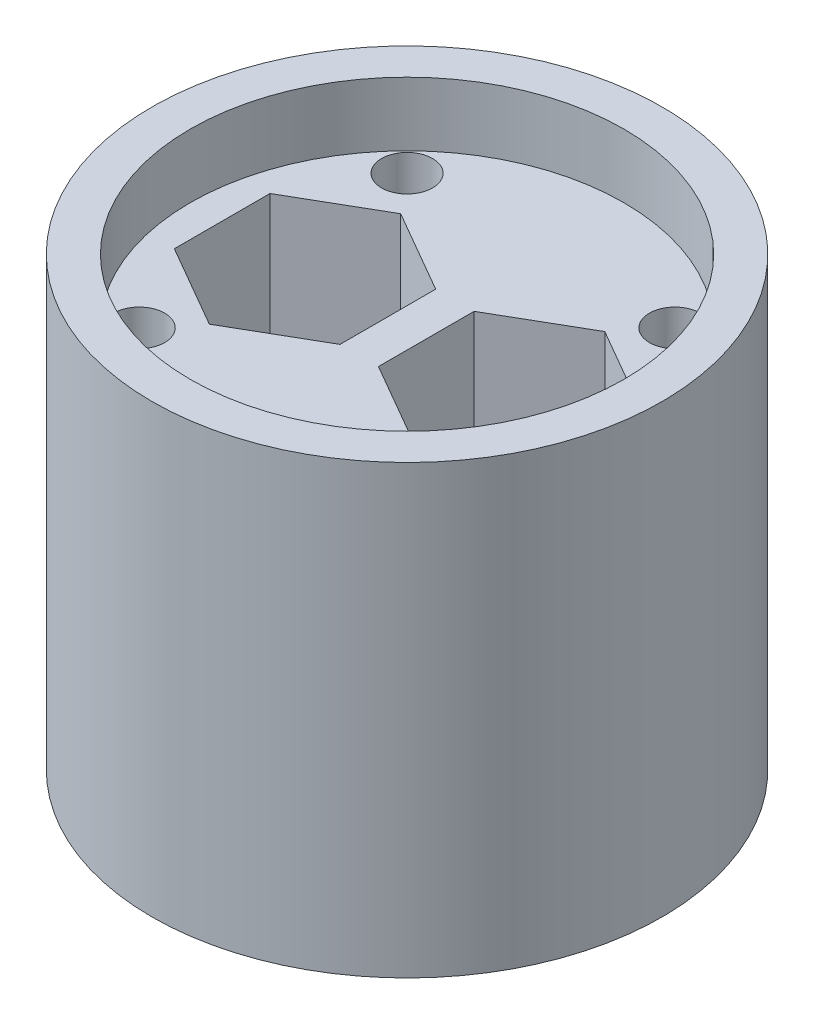
ISO-10303-21;
HEADER;
FILE_DESCRIPTION(('STEP AP214'),'2;1');
FILE_NAME('part.step','',(''),(''),'','','');
FILE_SCHEMA(('AUTOMOTIVE_DESIGN { 1 0 10303 214 1 1 1 1 }'));
ENDSEC;
DATA;
#1=APPLICATION_CONTEXT('core data for automotive mechanical design processes');
#2=APPLICATION_PROTOCOL_DEFINITION('international standard','automotive_design',2000,#1);
#3=PRODUCT_CONTEXT('',#1,'mechanical');
#4=PRODUCT('Part','Part','',(#3));
#5=PRODUCT_RELATED_PRODUCT_CATEGORY('part','',(#4));
#6=PRODUCT_DEFINITION_FORMATION('','',#4);
#7=PRODUCT_DEFINITION_CONTEXT('part definition',#1,'design');
#8=PRODUCT_DEFINITION('design','',#6,#7);
#9=PRODUCT_DEFINITION_SHAPE('','',#8);
#10=(LENGTH_UNIT() NAMED_UNIT(*) SI_UNIT(.MILLI.,.METRE.));
#11=(NAMED_UNIT(*) PLANE_ANGLE_UNIT() SI_UNIT($,.RADIAN.));
#12=(NAMED_UNIT(*) SI_UNIT($,.STERADIAN.) SOLID_ANGLE_UNIT());
#13=UNCERTAINTY_MEASURE_WITH_UNIT(LENGTH_MEASURE(1.E-05),#10,'distance_accuracy_value','');
#14=(GEOMETRIC_REPRESENTATION_CONTEXT(3) GLOBAL_UNCERTAINTY_ASSIGNED_CONTEXT((#13)) GLOBAL_UNIT_ASSIGNED_CONTEXT((#10,
#11,#12)) REPRESENTATION_CONTEXT('',''));
#15=CARTESIAN_POINT('',(0.,0.,0.));
#16=DIRECTION('',(0.,0.,1.));
#17=DIRECTION('',(1.,0.,0.));
#18=AXIS2_PLACEMENT_3D('',#15,#16,#17);
#19=CARTESIAN_POINT('',(-7.99999999999999,0.,0.));
#20=DIRECTION('',(0.,1.,0.));
#21=DIRECTION('',(0.,0.,1.));
#22=AXIS2_PLACEMENT_3D('',#19,#20,#21);
#23=CYLINDRICAL_SURFACE('',#22,4.1);
#24=CARTESIAN_POINT('',(-7.99999999999999,20.,0.));
#25=DIRECTION('',(0.,1.,0.));
#26=DIRECTION('',(0.,0.,1.));
#27=AXIS2_PLACEMENT_3D('',#24,#25,#26);
#28=CIRCLE('',#27,4.1);
#29=CARTESIAN_POINT('',(-7.99999999999999,20.,4.1));
#30=VERTEX_POINT('',#29);
#31=EDGE_CURVE('E251',#30,#30,#28,.T.);
#32=ORIENTED_EDGE('',*,*,#31,.T.);
#33=EDGE_LOOP('',(#32));
#34=FACE_BOUND('',#33,.T.);
#35=CARTESIAN_POINT('',(-7.99999999999999,2.,0.));
#36=DIRECTION('',(0.,-1.,0.));
#37=DIRECTION('',(0.,0.,-1.));
#38=AXIS2_PLACEMENT_3D('',#35,#36,#37);
#39=CIRCLE('',#38,4.1);
#40=CARTESIAN_POINT('',(-7.99999999999999,2.,-4.1));
#41=VERTEX_POINT('',#40);
#42=EDGE_CURVE('E194',#41,#41,#39,.F.);
#43=ORIENTED_EDGE('',*,*,#42,.F.);
#44=EDGE_LOOP('',(#43));
#45=FACE_BOUND('',#44,.T.);
#46=ADVANCED_FACE('F40',(#34,#45),#23,.F.);
#47=CARTESIAN_POINT('',(8.,0.,0.));
#48=DIRECTION('',(0.,1.,0.));
#49=DIRECTION('',(0.,0.,1.));
#50=AXIS2_PLACEMENT_3D('',#47,#48,#49);
#51=CYLINDRICAL_SURFACE('',#50,4.1);
#52=CARTESIAN_POINT('',(8.,20.,0.));
#53=DIRECTION('',(0.,1.,0.));
#54=DIRECTION('',(0.,0.,1.));
#55=AXIS2_PLACEMENT_3D('',#52,#53,#54);
#56=CIRCLE('',#55,4.1);
#57=CARTESIAN_POINT('',(8.,20.,4.1));
#58=VERTEX_POINT('',#57);
#59=EDGE_CURVE('E248',#58,#58,#56,.T.);
#60=ORIENTED_EDGE('',*,*,#59,.T.);
#61=EDGE_LOOP('',(#60));
#62=FACE_BOUND('',#61,.T.);
#63=CARTESIAN_POINT('',(8.,2.,0.));
#64=DIRECTION('',(0.,-1.,0.));
#65=DIRECTION('',(0.,0.,-1.));
#66=AXIS2_PLACEMENT_3D('',#63,#64,#65);
#67=CIRCLE('',#66,4.1);
#68=CARTESIAN_POINT('',(8.,2.,-4.1));
#69=VERTEX_POINT('',#68);
#70=EDGE_CURVE('E44',#69,#69,#67,.F.);
#71=ORIENTED_EDGE('',*,*,#70,.F.);
#72=EDGE_LOOP('',(#71));
#73=FACE_BOUND('',#72,.T.);
#74=ADVANCED_FACE('F352',(#62,#73),#51,.F.);
#75=CARTESIAN_POINT('',(-1.50480947161671,20.,-3.75));
#76=DIRECTION('',(0.5,0.,-0.866025403784439));
#77=DIRECTION('',(-0.866025403784439,0.,-0.5));
#78=AXIS2_PLACEMENT_3D('',#75,#76,#77);
#79=PLANE('',#78);
#80=DIRECTION('',(0.866025403784439,0.,0.5));
#81=VECTOR('',#80,1.);
#82=CARTESIAN_POINT('',(-1.50480947161671,30.,-3.75));
#83=LINE('',#82,#81);
#84=CARTESIAN_POINT('',(-8.,30.,-7.49999999999999));
#85=VERTEX_POINT('',#84);
#86=CARTESIAN_POINT('',(-1.50480947161671,30.,-3.75));
#87=VERTEX_POINT('',#86);
#88=EDGE_CURVE('E234',#85,#87,#83,.T.);
#89=ORIENTED_EDGE('',*,*,#88,.F.);
#90=DIRECTION('',(0.,1.,0.));
#91=VECTOR('',#90,1.);
#92=CARTESIAN_POINT('',(-8.,20.,-7.49999999999999));
#93=LINE('',#92,#91);
#94=CARTESIAN_POINT('',(-8.,20.,-7.49999999999999));
#95=VERTEX_POINT('',#94);
#96=EDGE_CURVE('E308',#95,#85,#93,.T.);
#97=ORIENTED_EDGE('',*,*,#96,.F.);
#98=DIRECTION('',(-0.866025403784439,0.,-0.5));
#99=VECTOR('',#98,1.);
#100=CARTESIAN_POINT('',(-1.50480947161671,20.,-3.75));
#101=LINE('',#100,#99);
#102=CARTESIAN_POINT('',(-1.50480947161671,20.,-3.75));
#103=VERTEX_POINT('',#102);
#104=EDGE_CURVE('E276',#103,#95,#101,.T.);
#105=ORIENTED_EDGE('',*,*,#104,.F.);
#106=DIRECTION('',(0.,1.,0.));
#107=VECTOR('',#106,1.);
#108=CARTESIAN_POINT('',(-1.50480947161671,20.,-3.75));
#109=LINE('',#108,#107);
#110=EDGE_CURVE('E309',#103,#87,#109,.T.);
#111=ORIENTED_EDGE('',*,*,#110,.T.);
#112=EDGE_LOOP('',(#89,#97,#105,#111));
#113=FACE_BOUND('',#112,.T.);
#114=ADVANCED_FACE('F359',(#113),#79,.F.);
#115=CARTESIAN_POINT('',(-1.50480947161671,20.,3.75));
#116=DIRECTION('',(1.,0.,0.));
#117=DIRECTION('',(0.,0.,-1.));
#118=AXIS2_PLACEMENT_3D('',#115,#116,#117);
#119=PLANE('',#118);
#120=DIRECTION('',(0.,0.,1.));
#121=VECTOR('',#120,1.);
#122=CARTESIAN_POINT('',(-1.50480947161671,30.,3.75));
#123=LINE('',#122,#121);
#124=CARTESIAN_POINT('',(-1.50480947161671,30.,3.75));
#125=VERTEX_POINT('',#124);
#126=EDGE_CURVE('E232',#87,#125,#123,.T.);
#127=ORIENTED_EDGE('',*,*,#126,.F.);
#128=ORIENTED_EDGE('',*,*,#110,.F.);
#129=DIRECTION('',(0.,0.,-1.));
#130=VECTOR('',#129,1.);
#131=CARTESIAN_POINT('',(-1.50480947161671,20.,3.75));
#132=LINE('',#131,#130);
#133=CARTESIAN_POINT('',(-1.50480947161671,20.,3.75));
#134=VERTEX_POINT('',#133);
#135=EDGE_CURVE('E305',#134,#103,#132,.T.);
#136=ORIENTED_EDGE('',*,*,#135,.F.);
#137=DIRECTION('',(0.,1.,0.));
#138=VECTOR('',#137,1.);
#139=CARTESIAN_POINT('',(-1.50480947161671,20.,3.75));
#140=LINE('',#139,#138);
#141=EDGE_CURVE('E312',#134,#125,#140,.T.);
#142=ORIENTED_EDGE('',*,*,#141,.T.);
#143=EDGE_LOOP('',(#127,#128,#136,#142));
#144=FACE_BOUND('',#143,.T.);
#145=ADVANCED_FACE('F400',(#144),#119,.F.);
#146=CARTESIAN_POINT('',(-8.,20.,7.5));
#147=DIRECTION('',(0.5,0.,0.866025403784439));
#148=DIRECTION('',(0.866025403784439,0.,-0.5));
#149=AXIS2_PLACEMENT_3D('',#146,#147,#148);
#150=PLANE('',#149);
#151=DIRECTION('',(-0.866025403784439,0.,0.5));
#152=VECTOR('',#151,1.);
#153=CARTESIAN_POINT('',(-8.,30.,7.5));
#154=LINE('',#153,#152);
#155=CARTESIAN_POINT('',(-8.,30.,7.5));
#156=VERTEX_POINT('',#155);
#157=EDGE_CURVE('E230',#125,#156,#154,.T.);
#158=ORIENTED_EDGE('',*,*,#157,.F.);
#159=ORIENTED_EDGE('',*,*,#141,.F.);
#160=DIRECTION('',(0.866025403784439,0.,-0.5));
#161=VECTOR('',#160,1.);
#162=CARTESIAN_POINT('',(-8.,20.,7.5));
#163=LINE('',#162,#161);
#164=CARTESIAN_POINT('',(-8.,20.,7.5));
#165=VERTEX_POINT('',#164);
#166=EDGE_CURVE('E302',#165,#134,#163,.T.);
#167=ORIENTED_EDGE('',*,*,#166,.F.);
#168=DIRECTION('',(0.,1.,0.));
#169=VECTOR('',#168,1.);
#170=CARTESIAN_POINT('',(-8.,20.,7.5));
#171=LINE('',#170,#169);
#172=EDGE_CURVE('E315',#165,#156,#171,.T.);
#173=ORIENTED_EDGE('',*,*,#172,.T.);
#174=EDGE_LOOP('',(#158,#159,#167,#173));
#175=FACE_BOUND('',#174,.T.);
#176=ADVANCED_FACE('F403',(#175),#150,.F.);
#177=CARTESIAN_POINT('',(-14.4951905283833,20.,3.75));
#178=DIRECTION('',(-0.5,0.,0.866025403784439));
#179=DIRECTION('',(0.866025403784439,0.,0.5));
#180=AXIS2_PLACEMENT_3D('',#177,#178,#179);
#181=PLANE('',#180);
#182=DIRECTION('',(-0.866025403784439,0.,-0.5));
#183=VECTOR('',#182,1.);
#184=CARTESIAN_POINT('',(-14.4951905283833,30.,3.75));
#185=LINE('',#184,#183);
#186=CARTESIAN_POINT('',(-14.4951905283833,30.,3.75));
#187=VERTEX_POINT('',#186);
#188=EDGE_CURVE('E228',#156,#187,#185,.T.);
#189=ORIENTED_EDGE('',*,*,#188,.F.);
#190=ORIENTED_EDGE('',*,*,#172,.F.);
#191=DIRECTION('',(0.866025403784439,0.,0.5));
#192=VECTOR('',#191,1.);
#193=CARTESIAN_POINT('',(-14.4951905283833,20.,3.75));
#194=LINE('',#193,#192);
#195=CARTESIAN_POINT('',(-14.4951905283833,20.,3.75));
#196=VERTEX_POINT('',#195);
#197=EDGE_CURVE('E299',#196,#165,#194,.T.);
#198=ORIENTED_EDGE('',*,*,#197,.F.);
#199=DIRECTION('',(0.,1.,0.));
#200=VECTOR('',#199,1.);
#201=CARTESIAN_POINT('',(-14.4951905283833,20.,3.75));
#202=LINE('',#201,#200);
#203=EDGE_CURVE('E318',#196,#187,#202,.T.);
#204=ORIENTED_EDGE('',*,*,#203,.T.);
#205=EDGE_LOOP('',(#189,#190,#198,#204));
#206=FACE_BOUND('',#205,.T.);
#207=ADVANCED_FACE('F407',(#206),#181,.F.);
#208=CARTESIAN_POINT('',(-14.4951905283833,20.,-3.75));
#209=DIRECTION('',(-1.,0.,0.));
#210=DIRECTION('',(0.,0.,1.));
#211=AXIS2_PLACEMENT_3D('',#208,#209,#210);
#212=PLANE('',#211);
#213=DIRECTION('',(0.,0.,-1.));
#214=VECTOR('',#213,1.);
#215=CARTESIAN_POINT('',(-14.4951905283833,30.,-3.75));
#216=LINE('',#215,#214);
#217=CARTESIAN_POINT('',(-14.4951905283833,30.,-3.75));
#218=VERTEX_POINT('',#217);
#219=EDGE_CURVE('E65',#187,#218,#216,.T.);
#220=ORIENTED_EDGE('',*,*,#219,.F.);
#221=ORIENTED_EDGE('',*,*,#203,.F.);
#222=DIRECTION('',(0.,0.,1.));
#223=VECTOR('',#222,1.);
#224=CARTESIAN_POINT('',(-14.4951905283833,20.,-3.75));
#225=LINE('',#224,#223);
#226=CARTESIAN_POINT('',(-14.4951905283833,20.,-3.75));
#227=VERTEX_POINT('',#226);
#228=EDGE_CURVE('E296',#227,#196,#225,.T.);
#229=ORIENTED_EDGE('',*,*,#228,.F.);
#230=DIRECTION('',(0.,1.,0.));
#231=VECTOR('',#230,1.);
#232=CARTESIAN_POINT('',(-14.4951905283833,20.,-3.75));
#233=LINE('',#232,#231);
#234=EDGE_CURVE('E321',#227,#218,#233,.T.);
#235=ORIENTED_EDGE('',*,*,#234,.T.);
#236=EDGE_LOOP('',(#220,#221,#229,#235));
#237=FACE_BOUND('',#236,.T.);
#238=ADVANCED_FACE('F411',(#237),#212,.F.);
#239=CARTESIAN_POINT('',(-8.,20.,-7.49999999999999));
#240=DIRECTION('',(-0.5,0.,-0.866025403784439));
#241=DIRECTION('',(-0.866025403784439,0.,0.5));
#242=AXIS2_PLACEMENT_3D('',#239,#240,#241);
#243=PLANE('',#242);
#244=DIRECTION('',(0.866025403784439,0.,-0.5));
#245=VECTOR('',#244,1.);
#246=CARTESIAN_POINT('',(-8.,30.,-7.49999999999999));
#247=LINE('',#246,#245);
#248=EDGE_CURVE('E225',#218,#85,#247,.T.);
#249=ORIENTED_EDGE('',*,*,#248,.F.);
#250=ORIENTED_EDGE('',*,*,#234,.F.);
#251=DIRECTION('',(-0.866025403784439,0.,0.5));
#252=VECTOR('',#251,1.);
#253=CARTESIAN_POINT('',(-8.,20.,-7.49999999999999));
#254=LINE('',#253,#252);
#255=EDGE_CURVE('E293',#95,#227,#254,.T.);
#256=ORIENTED_EDGE('',*,*,#255,.F.);
#257=ORIENTED_EDGE('',*,*,#96,.T.);
#258=EDGE_LOOP('',(#249,#250,#256,#257));
#259=FACE_BOUND('',#258,.T.);
#260=ADVANCED_FACE('F394',(#259),#243,.F.);
#261=CARTESIAN_POINT('',(14.4951905283833,20.,-3.75000000000001));
#262=DIRECTION('',(0.499999999999999,0.,-0.866025403784439));
#263=DIRECTION('',(-0.866025403784439,0.,-0.499999999999999));
#264=AXIS2_PLACEMENT_3D('',#261,#262,#263);
#265=PLANE('',#264);
#266=DIRECTION('',(0.866025403784439,0.,0.499999999999999));
#267=VECTOR('',#266,1.);
#268=CARTESIAN_POINT('',(14.4951905283833,30.,-3.75000000000001));
#269=LINE('',#268,#267);
#270=CARTESIAN_POINT('',(8.,30.,-7.5));
#271=VERTEX_POINT('',#270);
#272=CARTESIAN_POINT('',(14.4951905283833,30.,-3.75000000000001));
#273=VERTEX_POINT('',#272);
#274=EDGE_CURVE('E223',#271,#273,#269,.T.);
#275=ORIENTED_EDGE('',*,*,#274,.F.);
#276=DIRECTION('',(0.,1.,0.));
#277=VECTOR('',#276,1.);
#278=CARTESIAN_POINT('',(8.,20.,-7.5));
#279=LINE('',#278,#277);
#280=CARTESIAN_POINT('',(8.,20.,-7.5));
#281=VERTEX_POINT('',#280);
#282=EDGE_CURVE('E272',#281,#271,#279,.T.);
#283=ORIENTED_EDGE('',*,*,#282,.F.);
#284=DIRECTION('',(-0.866025403784439,0.,-0.499999999999999));
#285=VECTOR('',#284,1.);
#286=CARTESIAN_POINT('',(14.4951905283833,20.,-3.75000000000001));
#287=LINE('',#286,#285);
#288=CARTESIAN_POINT('',(14.4951905283833,20.,-3.75000000000001));
#289=VERTEX_POINT('',#288);
#290=EDGE_CURVE('E254',#289,#281,#287,.T.);
#291=ORIENTED_EDGE('',*,*,#290,.F.);
#292=DIRECTION('',(0.,1.,0.));
#293=VECTOR('',#292,1.);
#294=CARTESIAN_POINT('',(14.4951905283833,20.,-3.75000000000001));
#295=LINE('',#294,#293);
#296=EDGE_CURVE('E273',#289,#273,#295,.T.);
#297=ORIENTED_EDGE('',*,*,#296,.T.);
#298=EDGE_LOOP('',(#275,#283,#291,#297));
#299=FACE_BOUND('',#298,.T.);
#300=ADVANCED_FACE('F374',(#299),#265,.F.);
#301=CARTESIAN_POINT('',(14.4951905283833,20.,3.75));
#302=DIRECTION('',(1.,0.,0.));
#303=DIRECTION('',(0.,0.,-1.));
#304=AXIS2_PLACEMENT_3D('',#301,#302,#303);
#305=PLANE('',#304);
#306=DIRECTION('',(0.,0.,1.));
#307=VECTOR('',#306,1.);
#308=CARTESIAN_POINT('',(14.4951905283833,30.,3.75));
#309=LINE('',#308,#307);
#310=CARTESIAN_POINT('',(14.4951905283833,30.,3.75));
#311=VERTEX_POINT('',#310);
#312=EDGE_CURVE('E221',#273,#311,#309,.T.);
#313=ORIENTED_EDGE('',*,*,#312,.F.);
#314=ORIENTED_EDGE('',*,*,#296,.F.);
#315=DIRECTION('',(0.,0.,-1.));
#316=VECTOR('',#315,1.);
#317=CARTESIAN_POINT('',(14.4951905283833,20.,3.75));
#318=LINE('',#317,#316);
#319=CARTESIAN_POINT('',(14.4951905283833,20.,3.75));
#320=VERTEX_POINT('',#319);
#321=EDGE_CURVE('E269',#320,#289,#318,.T.);
#322=ORIENTED_EDGE('',*,*,#321,.F.);
#323=DIRECTION('',(0.,1.,0.));
#324=VECTOR('',#323,1.);
#325=CARTESIAN_POINT('',(14.4951905283833,20.,3.75));
#326=LINE('',#325,#324);
#327=EDGE_CURVE('E277',#320,#311,#326,.T.);
#328=ORIENTED_EDGE('',*,*,#327,.T.);
#329=EDGE_LOOP('',(#313,#314,#322,#328));
#330=FACE_BOUND('',#329,.T.);
#331=ADVANCED_FACE('F370',(#330),#305,.F.);
#332=CARTESIAN_POINT('',(8.00000000000001,20.,7.5));
#333=DIRECTION('',(0.5,0.,0.866025403784438));
#334=DIRECTION('',(0.866025403784439,0.,-0.5));
#335=AXIS2_PLACEMENT_3D('',#332,#333,#334);
#336=PLANE('',#335);
#337=DIRECTION('',(-0.866025403784439,0.,0.5));
#338=VECTOR('',#337,1.);
#339=CARTESIAN_POINT('',(8.00000000000001,30.,7.5));
#340=LINE('',#339,#338);
#341=CARTESIAN_POINT('',(8.00000000000001,30.,7.5));
#342=VERTEX_POINT('',#341);
#343=EDGE_CURVE('E219',#311,#342,#340,.T.);
#344=ORIENTED_EDGE('',*,*,#343,.F.);
#345=ORIENTED_EDGE('',*,*,#327,.F.);
#346=DIRECTION('',(0.866025403784438,0.,-0.5));
#347=VECTOR('',#346,1.);
#348=CARTESIAN_POINT('',(8.00000000000001,20.,7.5));
#349=LINE('',#348,#347);
#350=CARTESIAN_POINT('',(8.00000000000001,20.,7.5));
#351=VERTEX_POINT('',#350);
#352=EDGE_CURVE('E266',#351,#320,#349,.T.);
#353=ORIENTED_EDGE('',*,*,#352,.F.);
#354=DIRECTION('',(0.,1.,0.));
#355=VECTOR('',#354,1.);
#356=CARTESIAN_POINT('',(8.00000000000001,20.,7.5));
#357=LINE('',#356,#355);
#358=EDGE_CURVE('E280',#351,#342,#357,.T.);
#359=ORIENTED_EDGE('',*,*,#358,.T.);
#360=EDGE_LOOP('',(#344,#345,#353,#359));
#361=FACE_BOUND('',#360,.T.);
#362=ADVANCED_FACE('F373',(#361),#336,.F.);
#363=CARTESIAN_POINT('',(1.50480947161672,20.,3.75));
#364=DIRECTION('',(-0.5,0.,0.866025403784439));
#365=DIRECTION('',(0.866025403784439,0.,0.5));
#366=AXIS2_PLACEMENT_3D('',#363,#364,#365);
#367=PLANE('',#366);
#368=DIRECTION('',(-0.866025403784439,0.,-0.5));
#369=VECTOR('',#368,1.);
#370=CARTESIAN_POINT('',(1.50480947161672,30.,3.75));
#371=LINE('',#370,#369);
#372=CARTESIAN_POINT('',(1.50480947161672,30.,3.75));
#373=VERTEX_POINT('',#372);
#374=EDGE_CURVE('E217',#342,#373,#371,.T.);
#375=ORIENTED_EDGE('',*,*,#374,.F.);
#376=ORIENTED_EDGE('',*,*,#358,.F.);
#377=DIRECTION('',(0.866025403784439,0.,0.5));
#378=VECTOR('',#377,1.);
#379=CARTESIAN_POINT('',(1.50480947161672,20.,3.75));
#380=LINE('',#379,#378);
#381=CARTESIAN_POINT('',(1.50480947161672,20.,3.75));
#382=VERTEX_POINT('',#381);
#383=EDGE_CURVE('E263',#382,#351,#380,.T.);
#384=ORIENTED_EDGE('',*,*,#383,.F.);
#385=DIRECTION('',(0.,1.,0.));
#386=VECTOR('',#385,1.);
#387=CARTESIAN_POINT('',(1.50480947161672,20.,3.75));
#388=LINE('',#387,#386);
#389=EDGE_CURVE('E283',#382,#373,#388,.T.);
#390=ORIENTED_EDGE('',*,*,#389,.T.);
#391=EDGE_LOOP('',(#375,#376,#384,#390));
#392=FACE_BOUND('',#391,.T.);
#393=ADVANCED_FACE('F378',(#392),#367,.F.);
#394=CARTESIAN_POINT('',(1.50480947161671,20.,-3.75));
#395=DIRECTION('',(-1.,0.,0.));
#396=DIRECTION('',(0.,0.,1.));
#397=AXIS2_PLACEMENT_3D('',#394,#395,#396);
#398=PLANE('',#397);
#399=DIRECTION('',(0.,0.,-1.));
#400=VECTOR('',#399,1.);
#401=CARTESIAN_POINT('',(1.50480947161671,30.,-3.75));
#402=LINE('',#401,#400);
#403=CARTESIAN_POINT('',(1.50480947161671,30.,-3.75));
#404=VERTEX_POINT('',#403);
#405=EDGE_CURVE('E215',#373,#404,#402,.T.);
#406=ORIENTED_EDGE('',*,*,#405,.F.);
#407=ORIENTED_EDGE('',*,*,#389,.F.);
#408=DIRECTION('',(0.,0.,1.));
#409=VECTOR('',#408,1.);
#410=CARTESIAN_POINT('',(1.50480947161671,20.,-3.75));
#411=LINE('',#410,#409);
#412=CARTESIAN_POINT('',(1.50480947161671,20.,-3.75));
#413=VERTEX_POINT('',#412);
#414=EDGE_CURVE('E260',#413,#382,#411,.T.);
#415=ORIENTED_EDGE('',*,*,#414,.F.);
#416=DIRECTION('',(0.,1.,0.));
#417=VECTOR('',#416,1.);
#418=CARTESIAN_POINT('',(1.50480947161671,20.,-3.75));
#419=LINE('',#418,#417);
#420=EDGE_CURVE('E286',#413,#404,#419,.T.);
#421=ORIENTED_EDGE('',*,*,#420,.T.);
#422=EDGE_LOOP('',(#406,#407,#415,#421));
#423=FACE_BOUND('',#422,.T.);
#424=ADVANCED_FACE('F382',(#423),#398,.F.);
#425=CARTESIAN_POINT('',(8.,20.,-7.5));
#426=DIRECTION('',(-0.5,0.,-0.866025403784438));
#427=DIRECTION('',(-0.866025403784438,0.,0.5));
#428=AXIS2_PLACEMENT_3D('',#425,#426,#427);
#429=PLANE('',#428);
#430=DIRECTION('',(0.866025403784438,0.,-0.5));
#431=VECTOR('',#430,1.);
#432=CARTESIAN_POINT('',(8.,30.,-7.5));
#433=LINE('',#432,#431);
#434=EDGE_CURVE('E213',#404,#271,#433,.T.);
#435=ORIENTED_EDGE('',*,*,#434,.F.);
#436=ORIENTED_EDGE('',*,*,#420,.F.);
#437=DIRECTION('',(-0.866025403784438,0.,0.5));
#438=VECTOR('',#437,1.);
#439=CARTESIAN_POINT('',(8.,20.,-7.5));
#440=LINE('',#439,#438);
#441=EDGE_CURVE('E257',#281,#413,#440,.T.);
#442=ORIENTED_EDGE('',*,*,#441,.F.);
#443=ORIENTED_EDGE('',*,*,#282,.T.);
#444=EDGE_LOOP('',(#435,#436,#442,#443));
#445=FACE_BOUND('',#444,.T.);
#446=ADVANCED_FACE('F386',(#445),#429,.F.);
#447=CARTESIAN_POINT('',(-10.5,0.,-10.5));
#448=DIRECTION('',(0.,1.,0.));
#449=DIRECTION('',(0.,0.,1.));
#450=AXIS2_PLACEMENT_3D('',#447,#448,#449);
#451=CYLINDRICAL_SURFACE('',#450,2.);
#452=CARTESIAN_POINT('',(-10.5,0.,-10.5));
#453=DIRECTION('',(0.,1.,0.));
#454=DIRECTION('',(0.,0.,1.));
#455=AXIS2_PLACEMENT_3D('',#452,#453,#454);
#456=CIRCLE('',#455,2.);
#457=CARTESIAN_POINT('',(-10.5,0.,-8.5));
#458=VERTEX_POINT('',#457);
#459=EDGE_CURVE('E240',#458,#458,#456,.T.);
#460=ORIENTED_EDGE('',*,*,#459,.F.);
#461=EDGE_LOOP('',(#460));
#462=FACE_BOUND('',#461,.T.);
#463=CARTESIAN_POINT('',(-10.5,30.,-10.5));
#464=DIRECTION('',(0.,1.,0.));
#465=DIRECTION('',(0.,0.,1.));
#466=AXIS2_PLACEMENT_3D('',#463,#464,#465);
#467=CIRCLE('',#466,2.);
#468=CARTESIAN_POINT('',(-10.5,30.,-8.5));
#469=VERTEX_POINT('',#468);
#470=EDGE_CURVE('E210',#469,#469,#467,.F.);
#471=ORIENTED_EDGE('',*,*,#470,.F.);
#472=EDGE_LOOP('',(#471));
#473=FACE_BOUND('',#472,.T.);
#474=ADVANCED_FACE('F390',(#462,#473),#451,.F.);
#475=CARTESIAN_POINT('',(-10.5,0.,10.5));
#476=DIRECTION('',(0.,1.,0.));
#477=DIRECTION('',(0.,0.,1.));
#478=AXIS2_PLACEMENT_3D('',#475,#476,#477);
#479=CYLINDRICAL_SURFACE('',#478,2.);
#480=CARTESIAN_POINT('',(-10.5,0.,10.5));
#481=DIRECTION('',(0.,1.,0.));
#482=DIRECTION('',(0.,0.,1.));
#483=AXIS2_PLACEMENT_3D('',#480,#481,#482);
#484=CIRCLE('',#483,2.);
#485=CARTESIAN_POINT('',(-10.5,0.,12.5));
#486=VERTEX_POINT('',#485);
#487=EDGE_CURVE('E236',#486,#486,#484,.T.);
#488=ORIENTED_EDGE('',*,*,#487,.F.);
#489=EDGE_LOOP('',(#488));
#490=FACE_BOUND('',#489,.T.);
#491=CARTESIAN_POINT('',(-10.5,30.,10.5));
#492=DIRECTION('',(0.,1.,0.));
#493=DIRECTION('',(0.,0.,1.));
#494=AXIS2_PLACEMENT_3D('',#491,#492,#493);
#495=CIRCLE('',#494,2.);
#496=CARTESIAN_POINT('',(-10.5,30.,12.5));
#497=VERTEX_POINT('',#496);
#498=EDGE_CURVE('E207',#497,#497,#495,.F.);
#499=ORIENTED_EDGE('',*,*,#498,.F.);
#500=EDGE_LOOP('',(#499));
#501=FACE_BOUND('',#500,.T.);
#502=ADVANCED_FACE('F346',(#490,#501),#479,.F.);
#503=CARTESIAN_POINT('',(10.5,0.,10.5));
#504=DIRECTION('',(0.,1.,0.));
#505=DIRECTION('',(0.,0.,1.));
#506=AXIS2_PLACEMENT_3D('',#503,#504,#505);
#507=CYLINDRICAL_SURFACE('',#506,2.);
#508=CARTESIAN_POINT('',(10.5,0.,10.5));
#509=DIRECTION('',(0.,1.,0.));
#510=DIRECTION('',(0.,0.,1.));
#511=AXIS2_PLACEMENT_3D('',#508,#509,#510);
#512=CIRCLE('',#511,2.);
#513=CARTESIAN_POINT('',(10.5,0.,12.5));
#514=VERTEX_POINT('',#513);
#515=EDGE_CURVE('E241',#514,#514,#512,.T.);
#516=ORIENTED_EDGE('',*,*,#515,.F.);
#517=EDGE_LOOP('',(#516));
#518=FACE_BOUND('',#517,.T.);
#519=CARTESIAN_POINT('',(10.5,30.,10.5));
#520=DIRECTION('',(0.,1.,0.));
#521=DIRECTION('',(0.,0.,1.));
#522=AXIS2_PLACEMENT_3D('',#519,#520,#521);
#523=CIRCLE('',#522,2.);
#524=CARTESIAN_POINT('',(10.5,30.,12.5));
#525=VERTEX_POINT('',#524);
#526=EDGE_CURVE('E204',#525,#525,#523,.F.);
#527=ORIENTED_EDGE('',*,*,#526,.F.);
#528=EDGE_LOOP('',(#527));
#529=FACE_BOUND('',#528,.T.);
#530=ADVANCED_FACE('F336',(#518,#529),#507,.F.);
#531=CARTESIAN_POINT('',(10.5,0.,-10.5));
#532=DIRECTION('',(0.,1.,0.));
#533=DIRECTION('',(0.,0.,1.));
#534=AXIS2_PLACEMENT_3D('',#531,#532,#533);
#535=CYLINDRICAL_SURFACE('',#534,2.);
#536=CARTESIAN_POINT('',(10.5,0.,-10.5));
#537=DIRECTION('',(0.,1.,0.));
#538=DIRECTION('',(0.,0.,1.));
#539=AXIS2_PLACEMENT_3D('',#536,#537,#538);
#540=CIRCLE('',#539,2.);
#541=CARTESIAN_POINT('',(10.5,0.,-8.5));
#542=VERTEX_POINT('',#541);
#543=EDGE_CURVE('E237',#542,#542,#540,.T.);
#544=ORIENTED_EDGE('',*,*,#543,.F.);
#545=EDGE_LOOP('',(#544));
#546=FACE_BOUND('',#545,.T.);
#547=CARTESIAN_POINT('',(10.5,30.,-10.5));
#548=DIRECTION('',(0.,1.,0.));
#549=DIRECTION('',(0.,0.,1.));
#550=AXIS2_PLACEMENT_3D('',#547,#548,#549);
#551=CIRCLE('',#550,2.);
#552=CARTESIAN_POINT('',(10.5,30.,-8.5));
#553=VERTEX_POINT('',#552);
#554=EDGE_CURVE('E201',#553,#553,#551,.F.);
#555=ORIENTED_EDGE('',*,*,#554,.F.);
#556=EDGE_LOOP('',(#555));
#557=FACE_BOUND('',#556,.T.);
#558=ADVANCED_FACE('F334',(#546,#557),#535,.F.);
#559=CARTESIAN_POINT('',(0.,35.,0.));
#560=DIRECTION('',(0.,-1.,0.));
#561=DIRECTION('',(0.,0.,-1.));
#562=AXIS2_PLACEMENT_3D('',#559,#560,#561);
#563=CYLINDRICAL_SURFACE('',#562,20.);
#564=CARTESIAN_POINT('',(0.,35.,0.));
#565=DIRECTION('',(0.,1.,0.));
#566=DIRECTION('',(0.,0.,1.));
#567=AXIS2_PLACEMENT_3D('',#564,#565,#566);
#568=CIRCLE('',#567,20.);
#569=CARTESIAN_POINT('',(0.,35.,20.));
#570=VERTEX_POINT('',#569);
#571=EDGE_CURVE('E11',#570,#570,#568,.T.);
#572=ORIENTED_EDGE('',*,*,#571,.F.);
#573=EDGE_LOOP('',(#572));
#574=FACE_BOUND('',#573,.T.);
#575=CARTESIAN_POINT('',(0.,0.,0.));
#576=DIRECTION('',(0.,1.,0.));
#577=DIRECTION('',(0.,0.,1.));
#578=AXIS2_PLACEMENT_3D('',#575,#576,#577);
#579=CIRCLE('',#578,20.);
#580=CARTESIAN_POINT('',(0.,0.,20.));
#581=VERTEX_POINT('',#580);
#582=EDGE_CURVE('E49',#581,#581,#579,.T.);
#583=ORIENTED_EDGE('',*,*,#582,.T.);
#584=EDGE_LOOP('',(#583));
#585=FACE_BOUND('',#584,.T.);
#586=ADVANCED_FACE('F42',(#574,#585),#563,.T.);
#587=CARTESIAN_POINT('',(0.,35.,0.));
#588=DIRECTION('',(0.,1.,0.));
#589=DIRECTION('',(0.,0.,1.));
#590=AXIS2_PLACEMENT_3D('',#587,#588,#589);
#591=PLANE('',#590);
#592=CARTESIAN_POINT('',(0.,35.,0.));
#593=DIRECTION('',(0.,1.,0.));
#594=DIRECTION('',(0.,0.,1.));
#595=AXIS2_PLACEMENT_3D('',#592,#593,#594);
#596=CIRCLE('',#595,17.);
#597=CARTESIAN_POINT('',(0.,35.,17.));
#598=VERTEX_POINT('',#597);
#599=EDGE_CURVE('E197',#598,#598,#596,.T.);
#600=ORIENTED_EDGE('',*,*,#599,.F.);
#601=EDGE_LOOP('',(#600));
#602=FACE_BOUND('',#601,.T.);
#603=ORIENTED_EDGE('',*,*,#571,.T.);
#604=EDGE_LOOP('',(#603));
#605=FACE_BOUND('',#604,.T.);
#606=ADVANCED_FACE('F344',(#602,#605),#591,.T.);
#607=CARTESIAN_POINT('',(0.,0.,0.));
#608=DIRECTION('',(0.,1.,0.));
#609=DIRECTION('',(0.,0.,1.));
#610=AXIS2_PLACEMENT_3D('',#607,#608,#609);
#611=PLANE('',#610);
#612=DIRECTION('',(-1.,0.,0.));
#613=VECTOR('',#612,1.);
#614=CARTESIAN_POINT('',(8.,0.,8.1));
#615=LINE('',#614,#613);
#616=CARTESIAN_POINT('',(8.,0.,8.1));
#617=VERTEX_POINT('',#616);
#618=CARTESIAN_POINT('',(-7.99999999999999,0.,8.1));
#619=VERTEX_POINT('',#618);
#620=EDGE_CURVE('E185',#617,#619,#615,.T.);
#621=ORIENTED_EDGE('',*,*,#620,.F.);
#622=CARTESIAN_POINT('',(8.,0.,0.));
#623=DIRECTION('',(0.,-1.,0.));
#624=DIRECTION('',(0.,0.,-1.));
#625=AXIS2_PLACEMENT_3D('',#622,#623,#624);
#626=CIRCLE('',#625,8.1);
#627=CARTESIAN_POINT('',(8.,0.,-8.1));
#628=VERTEX_POINT('',#627);
#629=EDGE_CURVE('E57',#628,#617,#626,.T.);
#630=ORIENTED_EDGE('',*,*,#629,.F.);
#631=DIRECTION('',(1.,0.,0.));
#632=VECTOR('',#631,1.);
#633=CARTESIAN_POINT('',(8.,0.,-8.1));
#634=LINE('',#633,#632);
#635=CARTESIAN_POINT('',(-7.99999999999999,0.,-8.1));
#636=VERTEX_POINT('',#635);
#637=EDGE_CURVE('E176',#636,#628,#634,.T.);
#638=ORIENTED_EDGE('',*,*,#637,.F.);
#639=CARTESIAN_POINT('',(-7.99999999999999,0.,0.));
#640=DIRECTION('',(0.,-1.,0.));
#641=DIRECTION('',(0.,0.,1.));
#642=AXIS2_PLACEMENT_3D('',#639,#640,#641);
#643=CIRCLE('',#642,8.1);
#644=EDGE_CURVE('E179',#619,#636,#643,.T.);
#645=ORIENTED_EDGE('',*,*,#644,.F.);
#646=EDGE_LOOP('',(#621,#630,#638,#645));
#647=FACE_BOUND('',#646,.T.);
#648=ORIENTED_EDGE('',*,*,#543,.T.);
#649=EDGE_LOOP('',(#648));
#650=FACE_BOUND('',#649,.T.);
#651=ORIENTED_EDGE('',*,*,#515,.T.);
#652=EDGE_LOOP('',(#651));
#653=FACE_BOUND('',#652,.T.);
#654=ORIENTED_EDGE('',*,*,#487,.T.);
#655=EDGE_LOOP('',(#654));
#656=FACE_BOUND('',#655,.T.);
#657=ORIENTED_EDGE('',*,*,#459,.T.);
#658=EDGE_LOOP('',(#657));
#659=FACE_BOUND('',#658,.T.);
#660=ORIENTED_EDGE('',*,*,#582,.F.);
#661=EDGE_LOOP('',(#660));
#662=FACE_BOUND('',#661,.T.);
#663=ADVANCED_FACE('F398',(#647,#650,#653,#656,#659,#662),#611,.F.);
#664=CARTESIAN_POINT('',(0.,20.,0.));
#665=DIRECTION('',(0.,1.,0.));
#666=DIRECTION('',(0.,0.,1.));
#667=AXIS2_PLACEMENT_3D('',#664,#665,#666);
#668=PLANE('',#667);
#669=ORIENTED_EDGE('',*,*,#31,.F.);
#670=EDGE_LOOP('',(#669));
#671=FACE_BOUND('',#670,.T.);
#672=ORIENTED_EDGE('',*,*,#104,.T.);
#673=ORIENTED_EDGE('',*,*,#255,.T.);
#674=ORIENTED_EDGE('',*,*,#228,.T.);
#675=ORIENTED_EDGE('',*,*,#197,.T.);
#676=ORIENTED_EDGE('',*,*,#166,.T.);
#677=ORIENTED_EDGE('',*,*,#135,.T.);
#678=EDGE_LOOP('',(#672,#673,#674,#675,#676,#677));
#679=FACE_BOUND('',#678,.T.);
#680=ADVANCED_FACE('F368',(#671,#679),#668,.T.);
#681=CARTESIAN_POINT('',(0.,20.,0.));
#682=DIRECTION('',(0.,1.,0.));
#683=DIRECTION('',(0.,0.,1.));
#684=AXIS2_PLACEMENT_3D('',#681,#682,#683);
#685=PLANE('',#684);
#686=ORIENTED_EDGE('',*,*,#59,.F.);
#687=EDGE_LOOP('',(#686));
#688=FACE_BOUND('',#687,.T.);
#689=ORIENTED_EDGE('',*,*,#290,.T.);
#690=ORIENTED_EDGE('',*,*,#441,.T.);
#691=ORIENTED_EDGE('',*,*,#414,.T.);
#692=ORIENTED_EDGE('',*,*,#383,.T.);
#693=ORIENTED_EDGE('',*,*,#352,.T.);
#694=ORIENTED_EDGE('',*,*,#321,.T.);
#695=EDGE_LOOP('',(#689,#690,#691,#692,#693,#694));
#696=FACE_BOUND('',#695,.T.);
#697=ADVANCED_FACE('F365',(#688,#696),#685,.T.);
#698=CARTESIAN_POINT('',(0.,30.,0.));
#699=DIRECTION('',(0.,1.,0.));
#700=DIRECTION('',(0.,0.,1.));
#701=AXIS2_PLACEMENT_3D('',#698,#699,#700);
#702=PLANE('',#701);
#703=ORIENTED_EDGE('',*,*,#274,.T.);
#704=ORIENTED_EDGE('',*,*,#312,.T.);
#705=ORIENTED_EDGE('',*,*,#343,.T.);
#706=ORIENTED_EDGE('',*,*,#374,.T.);
#707=ORIENTED_EDGE('',*,*,#405,.T.);
#708=ORIENTED_EDGE('',*,*,#434,.T.);
#709=EDGE_LOOP('',(#703,#704,#705,#706,#707,#708));
#710=FACE_BOUND('',#709,.T.);
#711=CARTESIAN_POINT('',(0.,30.,0.));
#712=DIRECTION('',(0.,1.,0.));
#713=DIRECTION('',(0.,0.,1.));
#714=AXIS2_PLACEMENT_3D('',#711,#712,#713);
#715=CIRCLE('',#714,17.);
#716=CARTESIAN_POINT('',(0.,30.,17.));
#717=VERTEX_POINT('',#716);
#718=EDGE_CURVE('E198',#717,#717,#715,.T.);
#719=ORIENTED_EDGE('',*,*,#718,.T.);
#720=EDGE_LOOP('',(#719));
#721=FACE_BOUND('',#720,.T.);
#722=ORIENTED_EDGE('',*,*,#554,.T.);
#723=EDGE_LOOP('',(#722));
#724=FACE_BOUND('',#723,.T.);
#725=ORIENTED_EDGE('',*,*,#526,.T.);
#726=EDGE_LOOP('',(#725));
#727=FACE_BOUND('',#726,.T.);
#728=ORIENTED_EDGE('',*,*,#498,.T.);
#729=EDGE_LOOP('',(#728));
#730=FACE_BOUND('',#729,.T.);
#731=ORIENTED_EDGE('',*,*,#470,.T.);
#732=EDGE_LOOP('',(#731));
#733=FACE_BOUND('',#732,.T.);
#734=ORIENTED_EDGE('',*,*,#88,.T.);
#735=ORIENTED_EDGE('',*,*,#126,.T.);
#736=ORIENTED_EDGE('',*,*,#157,.T.);
#737=ORIENTED_EDGE('',*,*,#188,.T.);
#738=ORIENTED_EDGE('',*,*,#219,.T.);
#739=ORIENTED_EDGE('',*,*,#248,.T.);
#740=EDGE_LOOP('',(#734,#735,#736,#737,#738,#739));
#741=FACE_BOUND('',#740,.T.);
#742=ADVANCED_FACE('F331',(#710,#721,#724,#727,#730,#733,#741),#702,.T.);
#743=CARTESIAN_POINT('',(0.,30.,0.));
#744=DIRECTION('',(0.,1.,0.));
#745=DIRECTION('',(0.,0.,1.));
#746=AXIS2_PLACEMENT_3D('',#743,#744,#745);
#747=CYLINDRICAL_SURFACE('',#746,17.);
#748=ORIENTED_EDGE('',*,*,#718,.F.);
#749=EDGE_LOOP('',(#748));
#750=FACE_BOUND('',#749,.T.);
#751=ORIENTED_EDGE('',*,*,#599,.T.);
#752=EDGE_LOOP('',(#751));
#753=FACE_BOUND('',#752,.T.);
#754=ADVANCED_FACE('F444',(#750,#753),#747,.F.);
#755=CARTESIAN_POINT('',(8.,2.,0.));
#756=DIRECTION('',(0.,-1.,0.));
#757=DIRECTION('',(0.,0.,-1.));
#758=AXIS2_PLACEMENT_3D('',#755,#756,#757);
#759=PLANE('',#758);
#760=CARTESIAN_POINT('',(8.,2.,0.));
#761=DIRECTION('',(0.,-1.,0.));
#762=DIRECTION('',(0.,0.,-1.));
#763=AXIS2_PLACEMENT_3D('',#760,#761,#762);
#764=CIRCLE('',#763,8.1);
#765=CARTESIAN_POINT('',(8.,2.,-8.1));
#766=VERTEX_POINT('',#765);
#767=CARTESIAN_POINT('',(8.,2.,8.1));
#768=VERTEX_POINT('',#767);
#769=EDGE_CURVE('E157',#766,#768,#764,.T.);
#770=ORIENTED_EDGE('',*,*,#769,.T.);
#771=DIRECTION('',(-1.,0.,0.));
#772=VECTOR('',#771,1.);
#773=CARTESIAN_POINT('',(8.,2.,8.1));
#774=LINE('',#773,#772);
#775=CARTESIAN_POINT('',(-7.99999999999999,2.,8.1));
#776=VERTEX_POINT('',#775);
#777=EDGE_CURVE('E166',#768,#776,#774,.T.);
#778=ORIENTED_EDGE('',*,*,#777,.T.);
#779=CARTESIAN_POINT('',(-7.99999999999999,2.,0.));
#780=DIRECTION('',(0.,-1.,0.));
#781=DIRECTION('',(0.,0.,1.));
#782=AXIS2_PLACEMENT_3D('',#779,#780,#781);
#783=CIRCLE('',#782,8.1);
#784=CARTESIAN_POINT('',(-7.99999999999999,2.,-8.1));
#785=VERTEX_POINT('',#784);
#786=EDGE_CURVE('E171',#776,#785,#783,.T.);
#787=ORIENTED_EDGE('',*,*,#786,.T.);
#788=DIRECTION('',(1.,0.,0.));
#789=VECTOR('',#788,1.);
#790=CARTESIAN_POINT('',(8.,2.,-8.1));
#791=LINE('',#790,#789);
#792=EDGE_CURVE('E163',#785,#766,#791,.T.);
#793=ORIENTED_EDGE('',*,*,#792,.T.);
#794=EDGE_LOOP('',(#770,#778,#787,#793));
#795=FACE_BOUND('',#794,.T.);
#796=ORIENTED_EDGE('',*,*,#70,.T.);
#797=EDGE_LOOP('',(#796));
#798=FACE_BOUND('',#797,.T.);
#799=ORIENTED_EDGE('',*,*,#42,.T.);
#800=EDGE_LOOP('',(#799));
#801=FACE_BOUND('',#800,.T.);
#802=ADVANCED_FACE('F173',(#795,#798,#801),#759,.T.);
#803=CARTESIAN_POINT('',(8.,2.,0.));
#804=DIRECTION('',(0.,-1.,0.));
#805=DIRECTION('',(0.,0.,-1.));
#806=AXIS2_PLACEMENT_3D('',#803,#804,#805);
#807=CYLINDRICAL_SURFACE('',#806,8.1);
#808=ORIENTED_EDGE('',*,*,#629,.T.);
#809=DIRECTION('',(0.,-1.,0.));
#810=VECTOR('',#809,1.);
#811=CARTESIAN_POINT('',(8.,2.,8.1));
#812=LINE('',#811,#810);
#813=EDGE_CURVE('E153',#768,#617,#812,.T.);
#814=ORIENTED_EDGE('',*,*,#813,.F.);
#815=ORIENTED_EDGE('',*,*,#769,.F.);
#816=DIRECTION('',(0.,-1.,0.));
#817=VECTOR('',#816,1.);
#818=CARTESIAN_POINT('',(8.,2.,-8.1));
#819=LINE('',#818,#817);
#820=EDGE_CURVE('E189',#766,#628,#819,.T.);
#821=ORIENTED_EDGE('',*,*,#820,.T.);
#822=EDGE_LOOP('',(#808,#814,#815,#821));
#823=FACE_BOUND('',#822,.T.);
#824=ADVANCED_FACE('F155',(#823),#807,.F.);
#825=CARTESIAN_POINT('',(8.,2.,-8.1));
#826=DIRECTION('',(0.,0.,-1.));
#827=DIRECTION('',(-1.,0.,0.));
#828=AXIS2_PLACEMENT_3D('',#825,#826,#827);
#829=PLANE('',#828);
#830=ORIENTED_EDGE('',*,*,#637,.T.);
#831=ORIENTED_EDGE('',*,*,#820,.F.);
#832=ORIENTED_EDGE('',*,*,#792,.F.);
#833=DIRECTION('',(0.,-1.,0.));
#834=VECTOR('',#833,1.);
#835=CARTESIAN_POINT('',(-7.99999999999999,2.,-8.1));
#836=LINE('',#835,#834);
#837=EDGE_CURVE('E191',#785,#636,#836,.T.);
#838=ORIENTED_EDGE('',*,*,#837,.T.);
#839=EDGE_LOOP('',(#830,#831,#832,#838));
#840=FACE_BOUND('',#839,.T.);
#841=ADVANCED_FACE('F466',(#840),#829,.F.);
#842=CARTESIAN_POINT('',(-7.99999999999999,2.,0.));
#843=DIRECTION('',(0.,-1.,0.));
#844=DIRECTION('',(0.,0.,-1.));
#845=AXIS2_PLACEMENT_3D('',#842,#843,#844);
#846=CYLINDRICAL_SURFACE('',#845,8.1);
#847=ORIENTED_EDGE('',*,*,#644,.T.);
#848=ORIENTED_EDGE('',*,*,#837,.F.);
#849=ORIENTED_EDGE('',*,*,#786,.F.);
#850=DIRECTION('',(0.,-1.,0.));
#851=VECTOR('',#850,1.);
#852=CARTESIAN_POINT('',(-7.99999999999999,2.,8.1));
#853=LINE('',#852,#851);
#854=EDGE_CURVE('E162',#776,#619,#853,.T.);
#855=ORIENTED_EDGE('',*,*,#854,.T.);
#856=EDGE_LOOP('',(#847,#848,#849,#855));
#857=FACE_BOUND('',#856,.T.);
#858=ADVANCED_FACE('F469',(#857),#846,.F.);
#859=CARTESIAN_POINT('',(8.,2.,8.1));
#860=DIRECTION('',(0.,0.,1.));
#861=DIRECTION('',(1.,0.,0.));
#862=AXIS2_PLACEMENT_3D('',#859,#860,#861);
#863=PLANE('',#862);
#864=ORIENTED_EDGE('',*,*,#620,.T.);
#865=ORIENTED_EDGE('',*,*,#854,.F.);
#866=ORIENTED_EDGE('',*,*,#777,.F.);
#867=ORIENTED_EDGE('',*,*,#813,.T.);
#868=EDGE_LOOP('',(#864,#865,#866,#867));
#869=FACE_BOUND('',#868,.T.);
#870=ADVANCED_FACE('F167',(#869),#863,.F.);
#871=CLOSED_SHELL('',(#46,#74,#114,#145,#176,#207,#238,#260,#300,#331,#362,#393,#424,#446,#474,
#502,#530,#558,#586,#606,#663,#680,#697,#742,#754,#802,#824,#841,#858,#870));
#872=MANIFOLD_SOLID_BREP('B2',#871);
#873=ADVANCED_BREP_SHAPE_REPRESENTATION('',(#18,#872),#14);
#874=SHAPE_DEFINITION_REPRESENTATION(#9,#873);
ENDSEC;
END-ISO-10303-21;
